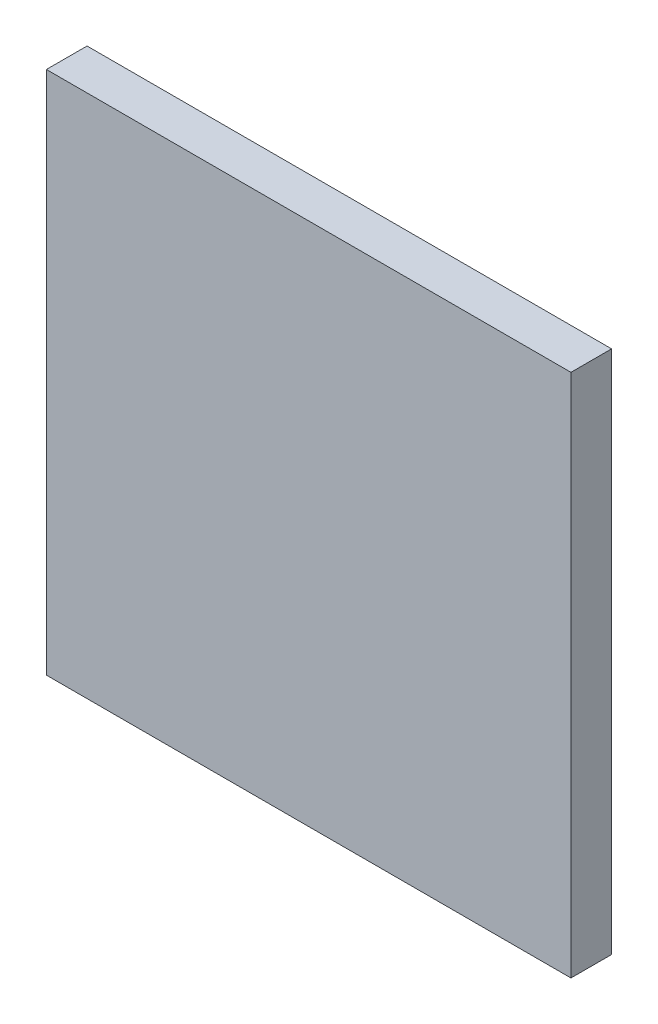
ISO-10303-21;
HEADER;
FILE_DESCRIPTION(('STEP AP214'),'2;1');
FILE_NAME('part.step','',(''),(''),'','','');
FILE_SCHEMA(('AUTOMOTIVE_DESIGN { 1 0 10303 214 1 1 1 1 }'));
ENDSEC;
DATA;
#1=APPLICATION_CONTEXT('core data for automotive mechanical design processes');
#2=APPLICATION_PROTOCOL_DEFINITION('international standard','automotive_design',2000,#1);
#3=PRODUCT_CONTEXT('',#1,'mechanical');
#4=PRODUCT('Part','Part','',(#3));
#5=PRODUCT_RELATED_PRODUCT_CATEGORY('part','',(#4));
#6=PRODUCT_DEFINITION_FORMATION('','',#4);
#7=PRODUCT_DEFINITION_CONTEXT('part definition',#1,'design');
#8=PRODUCT_DEFINITION('design','',#6,#7);
#9=PRODUCT_DEFINITION_SHAPE('','',#8);
#10=(LENGTH_UNIT() NAMED_UNIT(*) SI_UNIT(.MILLI.,.METRE.));
#11=(NAMED_UNIT(*) PLANE_ANGLE_UNIT() SI_UNIT($,.RADIAN.));
#12=(NAMED_UNIT(*) SI_UNIT($,.STERADIAN.) SOLID_ANGLE_UNIT());
#13=UNCERTAINTY_MEASURE_WITH_UNIT(LENGTH_MEASURE(1.E-05),#10,'distance_accuracy_value','');
#14=(GEOMETRIC_REPRESENTATION_CONTEXT(3) GLOBAL_UNCERTAINTY_ASSIGNED_CONTEXT((#13)) GLOBAL_UNIT_ASSIGNED_CONTEXT((#10,
#11,#12)) REPRESENTATION_CONTEXT('',''));
#15=CARTESIAN_POINT('',(0.,0.,0.));
#16=DIRECTION('',(0.,0.,1.));
#17=DIRECTION('',(1.,0.,0.));
#18=AXIS2_PLACEMENT_3D('',#15,#16,#17);
#19=CARTESIAN_POINT('',(-10.00000032,-10.00000032,1.54999944));
#20=DIRECTION('',(0.,0.,1.));
#21=DIRECTION('',(1.,0.,0.));
#22=AXIS2_PLACEMENT_3D('',#19,#20,#21);
#23=PLANE('',#22);
#24=DIRECTION('',(1.,0.,0.));
#25=VECTOR('',#24,1.);
#26=CARTESIAN_POINT('',(-10.00000032,10.00000032,1.54999944));
#27=LINE('',#26,#25);
#28=CARTESIAN_POINT('',(-10.00000032,10.00000032,1.54999944));
#29=VERTEX_POINT('',#28);
#30=CARTESIAN_POINT('',(10.00000032,10.00000032,1.54999944));
#31=VERTEX_POINT('',#30);
#32=EDGE_CURVE('E52',#29,#31,#27,.T.);
#33=ORIENTED_EDGE('',*,*,#32,.F.);
#34=DIRECTION('',(0.,1.,0.));
#35=VECTOR('',#34,1.);
#36=CARTESIAN_POINT('',(-10.00000032,-10.00000032,1.54999944));
#37=LINE('',#36,#35);
#38=CARTESIAN_POINT('',(-10.00000032,-10.00000032,1.54999944));
#39=VERTEX_POINT('',#38);
#40=EDGE_CURVE('E67',#39,#29,#37,.T.);
#41=ORIENTED_EDGE('',*,*,#40,.F.);
#42=DIRECTION('',(1.,0.,0.));
#43=VECTOR('',#42,1.);
#44=CARTESIAN_POINT('',(10.00000032,-10.00000032,1.54999944));
#45=LINE('',#44,#43);
#46=CARTESIAN_POINT('',(10.00000032,-10.00000032,1.54999944));
#47=VERTEX_POINT('',#46);
#48=EDGE_CURVE('E19',#47,#39,#45,.F.);
#49=ORIENTED_EDGE('',*,*,#48,.F.);
#50=DIRECTION('',(0.,1.,0.));
#51=VECTOR('',#50,1.);
#52=CARTESIAN_POINT('',(10.00000032,10.00000032,1.54999944));
#53=LINE('',#52,#51);
#54=EDGE_CURVE('E57',#31,#47,#53,.F.);
#55=ORIENTED_EDGE('',*,*,#54,.F.);
#56=EDGE_LOOP('',(#33,#41,#49,#55));
#57=FACE_BOUND('',#56,.T.);
#58=ADVANCED_FACE('F16',(#57),#23,.T.);
#59=CARTESIAN_POINT('',(10.00000032,-10.00000032,0.));
#60=DIRECTION('',(0.,-1.,0.));
#61=DIRECTION('',(0.,0.,-1.));
#62=AXIS2_PLACEMENT_3D('',#59,#60,#61);
#63=PLANE('',#62);
#64=DIRECTION('',(0.,0.,1.));
#65=VECTOR('',#64,1.);
#66=CARTESIAN_POINT('',(-10.00000032,-10.00000032,0.));
#67=LINE('',#66,#65);
#68=CARTESIAN_POINT('',(-10.00000032,-10.00000032,0.));
#69=VERTEX_POINT('',#68);
#70=EDGE_CURVE('E78',#69,#39,#67,.T.);
#71=ORIENTED_EDGE('',*,*,#70,.F.);
#72=DIRECTION('',(1.,0.,0.));
#73=VECTOR('',#72,1.);
#74=CARTESIAN_POINT('',(-10.00000032,-10.00000032,0.));
#75=LINE('',#74,#73);
#76=CARTESIAN_POINT('',(10.00000032,-10.00000032,0.));
#77=VERTEX_POINT('',#76);
#78=EDGE_CURVE('E73',#69,#77,#75,.T.);
#79=ORIENTED_EDGE('',*,*,#78,.T.);
#80=DIRECTION('',(0.,0.,-1.));
#81=VECTOR('',#80,1.);
#82=CARTESIAN_POINT('',(10.00000032,-10.00000032,0.));
#83=LINE('',#82,#81);
#84=EDGE_CURVE('E62',#47,#77,#83,.T.);
#85=ORIENTED_EDGE('',*,*,#84,.F.);
#86=ORIENTED_EDGE('',*,*,#48,.T.);
#87=EDGE_LOOP('',(#71,#79,#85,#86));
#88=FACE_BOUND('',#87,.T.);
#89=ADVANCED_FACE('F72',(#88),#63,.T.);
#90=CARTESIAN_POINT('',(10.00000032,10.00000032,0.));
#91=DIRECTION('',(1.,0.,0.));
#92=DIRECTION('',(0.,0.,-1.));
#93=AXIS2_PLACEMENT_3D('',#90,#91,#92);
#94=PLANE('',#93);
#95=ORIENTED_EDGE('',*,*,#84,.T.);
#96=DIRECTION('',(0.,1.,0.));
#97=VECTOR('',#96,1.);
#98=CARTESIAN_POINT('',(10.00000032,-10.00000032,0.));
#99=LINE('',#98,#97);
#100=CARTESIAN_POINT('',(10.00000032,10.00000032,0.));
#101=VERTEX_POINT('',#100);
#102=EDGE_CURVE('E83',#77,#101,#99,.T.);
#103=ORIENTED_EDGE('',*,*,#102,.T.);
#104=DIRECTION('',(0.,0.,1.));
#105=VECTOR('',#104,1.);
#106=CARTESIAN_POINT('',(10.00000032,10.00000032,0.));
#107=LINE('',#106,#105);
#108=EDGE_CURVE('E64',#31,#101,#107,.F.);
#109=ORIENTED_EDGE('',*,*,#108,.F.);
#110=ORIENTED_EDGE('',*,*,#54,.T.);
#111=EDGE_LOOP('',(#95,#103,#109,#110));
#112=FACE_BOUND('',#111,.T.);
#113=ADVANCED_FACE('F59',(#112),#94,.T.);
#114=CARTESIAN_POINT('',(-10.00000032,10.00000032,0.));
#115=DIRECTION('',(0.,1.,0.));
#116=DIRECTION('',(0.,0.,1.));
#117=AXIS2_PLACEMENT_3D('',#114,#115,#116);
#118=PLANE('',#117);
#119=ORIENTED_EDGE('',*,*,#108,.T.);
#120=DIRECTION('',(1.,0.,0.));
#121=VECTOR('',#120,1.);
#122=CARTESIAN_POINT('',(-10.00000032,10.00000032,0.));
#123=LINE('',#122,#121);
#124=CARTESIAN_POINT('',(-10.00000032,10.00000032,0.));
#125=VERTEX_POINT('',#124);
#126=EDGE_CURVE('E25',#101,#125,#123,.F.);
#127=ORIENTED_EDGE('',*,*,#126,.T.);
#128=DIRECTION('',(0.,0.,1.));
#129=VECTOR('',#128,1.);
#130=CARTESIAN_POINT('',(-10.00000032,10.00000032,0.));
#131=LINE('',#130,#129);
#132=EDGE_CURVE('E33',#29,#125,#131,.F.);
#133=ORIENTED_EDGE('',*,*,#132,.F.);
#134=ORIENTED_EDGE('',*,*,#32,.T.);
#135=EDGE_LOOP('',(#119,#127,#133,#134));
#136=FACE_BOUND('',#135,.T.);
#137=ADVANCED_FACE('F87',(#136),#118,.T.);
#138=CARTESIAN_POINT('',(-10.00000032,-10.00000032,0.));
#139=DIRECTION('',(-1.,0.,0.));
#140=DIRECTION('',(0.,0.,1.));
#141=AXIS2_PLACEMENT_3D('',#138,#139,#140);
#142=PLANE('',#141);
#143=ORIENTED_EDGE('',*,*,#132,.T.);
#144=DIRECTION('',(0.,1.,0.));
#145=VECTOR('',#144,1.);
#146=CARTESIAN_POINT('',(-10.00000032,-10.00000032,0.));
#147=LINE('',#146,#145);
#148=EDGE_CURVE('E10',#125,#69,#147,.F.);
#149=ORIENTED_EDGE('',*,*,#148,.T.);
#150=ORIENTED_EDGE('',*,*,#70,.T.);
#151=ORIENTED_EDGE('',*,*,#40,.T.);
#152=EDGE_LOOP('',(#143,#149,#150,#151));
#153=FACE_BOUND('',#152,.T.);
#154=ADVANCED_FACE('F90',(#153),#142,.T.);
#155=CARTESIAN_POINT('',(-10.00000032,-10.00000032,0.));
#156=DIRECTION('',(0.,0.,1.));
#157=DIRECTION('',(1.,0.,0.));
#158=AXIS2_PLACEMENT_3D('',#155,#156,#157);
#159=PLANE('',#158);
#160=ORIENTED_EDGE('',*,*,#126,.F.);
#161=ORIENTED_EDGE('',*,*,#102,.F.);
#162=ORIENTED_EDGE('',*,*,#78,.F.);
#163=ORIENTED_EDGE('',*,*,#148,.F.);
#164=EDGE_LOOP('',(#160,#161,#162,#163));
#165=FACE_BOUND('',#164,.T.);
#166=ADVANCED_FACE('F89',(#165),#159,.F.);
#167=CLOSED_SHELL('',(#58,#89,#113,#137,#154,#166));
#168=MANIFOLD_SOLID_BREP('B1',#167);
#169=ADVANCED_BREP_SHAPE_REPRESENTATION('',(#18,#168),#14);
#170=SHAPE_DEFINITION_REPRESENTATION(#9,#169);
ENDSEC;
END-ISO-10303-21;
